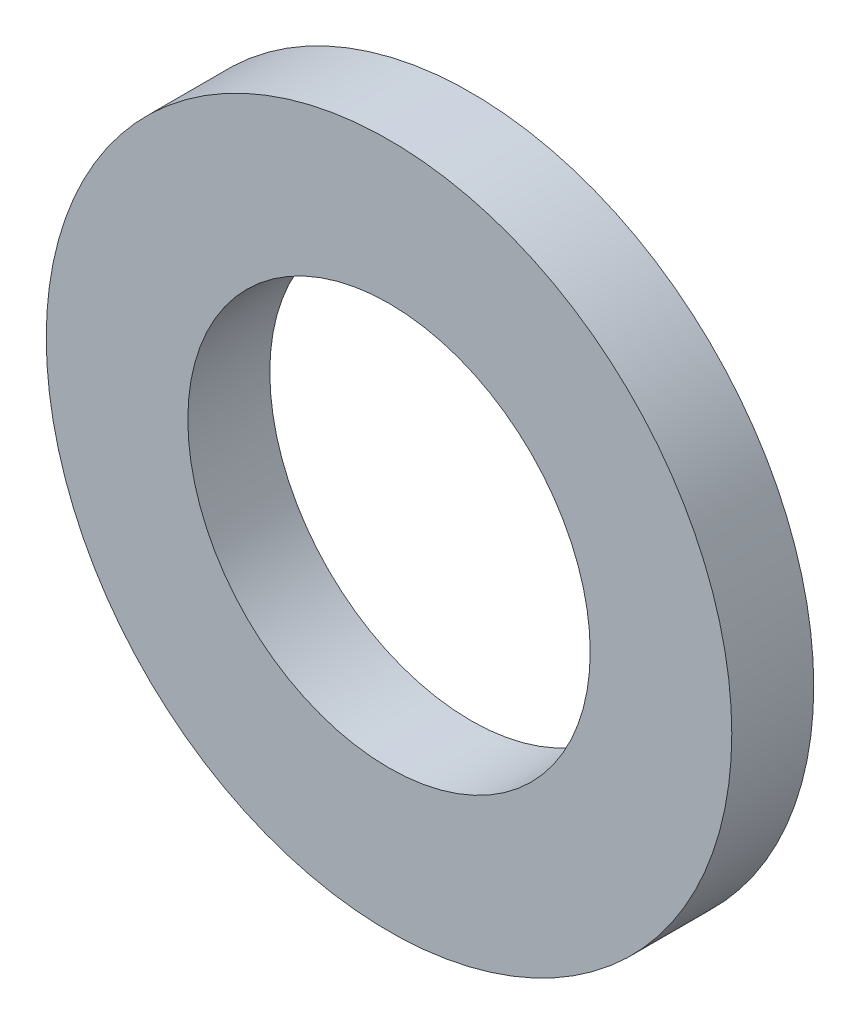
ISO-10303-21;
HEADER;
FILE_DESCRIPTION(('STEP AP214'),'2;1');
FILE_NAME('part.step','',(''),(''),'','','');
FILE_SCHEMA(('AUTOMOTIVE_DESIGN { 1 0 10303 214 1 1 1 1 }'));
ENDSEC;
DATA;
#1=APPLICATION_CONTEXT('core data for automotive mechanical design processes');
#2=APPLICATION_PROTOCOL_DEFINITION('international standard','automotive_design',2000,#1);
#3=PRODUCT_CONTEXT('',#1,'mechanical');
#4=PRODUCT('Part','Part','',(#3));
#5=PRODUCT_RELATED_PRODUCT_CATEGORY('part','',(#4));
#6=PRODUCT_DEFINITION_FORMATION('','',#4);
#7=PRODUCT_DEFINITION_CONTEXT('part definition',#1,'design');
#8=PRODUCT_DEFINITION('design','',#6,#7);
#9=PRODUCT_DEFINITION_SHAPE('','',#8);
#10=(LENGTH_UNIT() NAMED_UNIT(*) SI_UNIT(.MILLI.,.METRE.));
#11=(NAMED_UNIT(*) PLANE_ANGLE_UNIT() SI_UNIT($,.RADIAN.));
#12=(NAMED_UNIT(*) SI_UNIT($,.STERADIAN.) SOLID_ANGLE_UNIT());
#13=UNCERTAINTY_MEASURE_WITH_UNIT(LENGTH_MEASURE(1.E-05),#10,'distance_accuracy_value','');
#14=(GEOMETRIC_REPRESENTATION_CONTEXT(3) GLOBAL_UNCERTAINTY_ASSIGNED_CONTEXT((#13)) GLOBAL_UNIT_ASSIGNED_CONTEXT((#10,
#11,#12)) REPRESENTATION_CONTEXT('',''));
#15=CARTESIAN_POINT('',(0.,0.,0.));
#16=DIRECTION('',(0.,0.,1.));
#17=DIRECTION('',(1.,0.,0.));
#18=AXIS2_PLACEMENT_3D('',#15,#16,#17);
#19=CARTESIAN_POINT('',(0.,0.,1.1));
#20=DIRECTION('',(0.,0.,1.));
#21=DIRECTION('',(1.,0.,0.));
#22=AXIS2_PLACEMENT_3D('',#19,#20,#21);
#23=PLANE('',#22);
#24=CARTESIAN_POINT('',(0.,0.,1.1));
#25=DIRECTION('',(0.,0.,1.));
#26=DIRECTION('',(1.,0.,0.));
#27=AXIS2_PLACEMENT_3D('',#24,#25,#26);
#28=CIRCLE('',#27,4.6);
#29=CARTESIAN_POINT('',(4.6,0.,1.1));
#30=VERTEX_POINT('',#29);
#31=EDGE_CURVE('E10',#30,#30,#28,.T.);
#32=ORIENTED_EDGE('',*,*,#31,.T.);
#33=EDGE_LOOP('',(#32));
#34=FACE_BOUND('',#33,.T.);
#35=CARTESIAN_POINT('',(0.,0.,1.1));
#36=DIRECTION('',(0.,0.,1.));
#37=DIRECTION('',(1.,0.,0.));
#38=AXIS2_PLACEMENT_3D('',#35,#36,#37);
#39=CIRCLE('',#38,2.7);
#40=CARTESIAN_POINT('',(2.7,0.,1.1));
#41=VERTEX_POINT('',#40);
#42=EDGE_CURVE('E42',#41,#41,#39,.T.);
#43=ORIENTED_EDGE('',*,*,#42,.F.);
#44=EDGE_LOOP('',(#43));
#45=FACE_BOUND('',#44,.T.);
#46=ADVANCED_FACE('F31',(#34,#45),#23,.T.);
#47=CARTESIAN_POINT('',(0.,0.,0.));
#48=DIRECTION('',(0.,0.,1.));
#49=DIRECTION('',(1.,0.,0.));
#50=AXIS2_PLACEMENT_3D('',#47,#48,#49);
#51=PLANE('',#50);
#52=CARTESIAN_POINT('',(0.,0.,0.));
#53=DIRECTION('',(0.,0.,1.));
#54=DIRECTION('',(1.,0.,0.));
#55=AXIS2_PLACEMENT_3D('',#52,#53,#54);
#56=CIRCLE('',#55,4.6);
#57=CARTESIAN_POINT('',(4.6,0.,0.));
#58=VERTEX_POINT('',#57);
#59=EDGE_CURVE('E35',#58,#58,#56,.T.);
#60=ORIENTED_EDGE('',*,*,#59,.F.);
#61=EDGE_LOOP('',(#60));
#62=FACE_BOUND('',#61,.T.);
#63=CARTESIAN_POINT('',(0.,0.,0.));
#64=DIRECTION('',(0.,0.,1.));
#65=DIRECTION('',(1.,0.,0.));
#66=AXIS2_PLACEMENT_3D('',#63,#64,#65);
#67=CIRCLE('',#66,2.7);
#68=CARTESIAN_POINT('',(2.7,0.,0.));
#69=VERTEX_POINT('',#68);
#70=EDGE_CURVE('E44',#69,#69,#67,.T.);
#71=ORIENTED_EDGE('',*,*,#70,.T.);
#72=EDGE_LOOP('',(#71));
#73=FACE_BOUND('',#72,.T.);
#74=ADVANCED_FACE('F54',(#62,#73),#51,.F.);
#75=CARTESIAN_POINT('',(0.,0.,1.1));
#76=DIRECTION('',(0.,0.,-1.));
#77=DIRECTION('',(-1.,0.,0.));
#78=AXIS2_PLACEMENT_3D('',#75,#76,#77);
#79=CYLINDRICAL_SURFACE('',#78,4.6);
#80=ORIENTED_EDGE('',*,*,#31,.F.);
#81=EDGE_LOOP('',(#80));
#82=FACE_BOUND('',#81,.T.);
#83=ORIENTED_EDGE('',*,*,#59,.T.);
#84=EDGE_LOOP('',(#83));
#85=FACE_BOUND('',#84,.T.);
#86=ADVANCED_FACE('F33',(#82,#85),#79,.T.);
#87=CARTESIAN_POINT('',(0.,0.,1.1));
#88=DIRECTION('',(0.,0.,-1.));
#89=DIRECTION('',(-1.,0.,0.));
#90=AXIS2_PLACEMENT_3D('',#87,#88,#89);
#91=CYLINDRICAL_SURFACE('',#90,2.7);
#92=ORIENTED_EDGE('',*,*,#42,.T.);
#93=EDGE_LOOP('',(#92));
#94=FACE_BOUND('',#93,.T.);
#95=ORIENTED_EDGE('',*,*,#70,.F.);
#96=EDGE_LOOP('',(#95));
#97=FACE_BOUND('',#96,.T.);
#98=ADVANCED_FACE('F50',(#94,#97),#91,.F.);
#99=CLOSED_SHELL('',(#46,#74,#86,#98));
#100=MANIFOLD_SOLID_BREP('B2',#99);
#101=ADVANCED_BREP_SHAPE_REPRESENTATION('',(#18,#100),#14);
#102=SHAPE_DEFINITION_REPRESENTATION(#9,#101);
ENDSEC;
END-ISO-10303-21;
